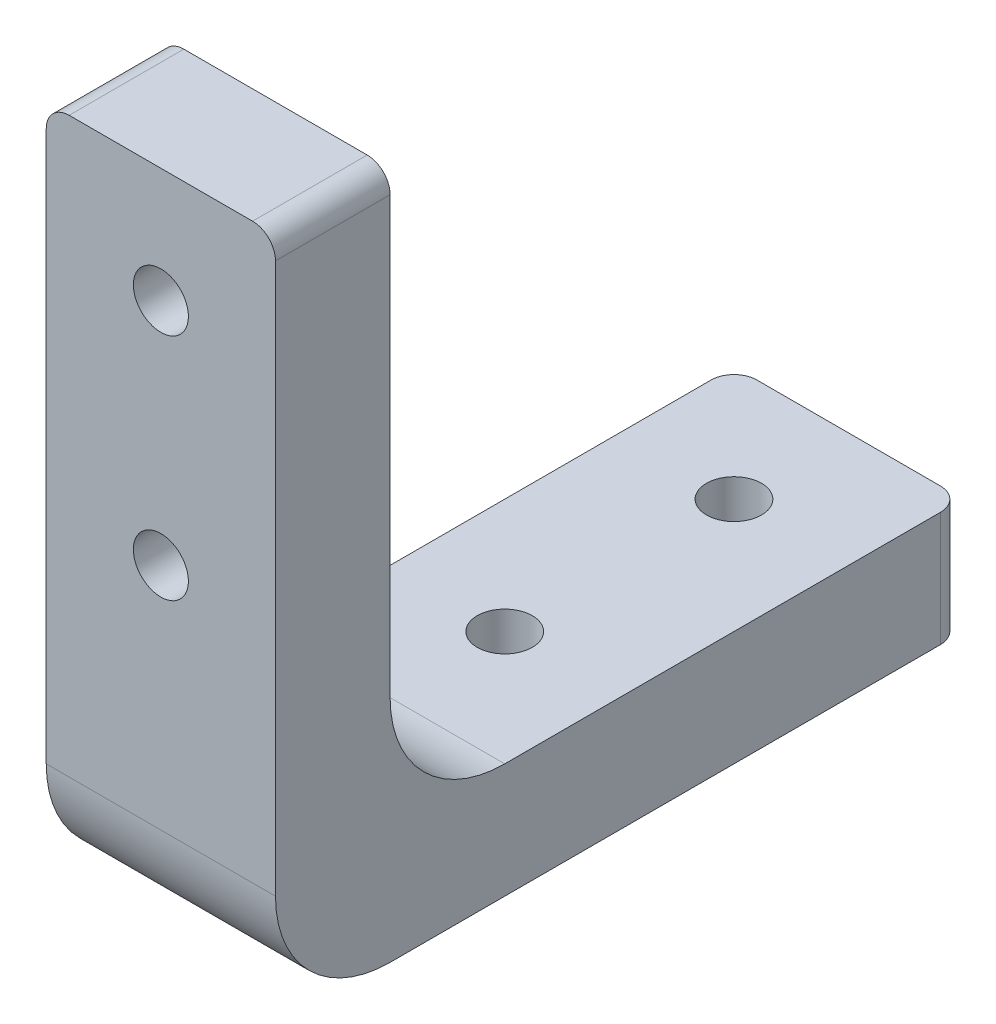
ISO-10303-21;
HEADER;
FILE_DESCRIPTION(('STEP AP214'),'2;1');
FILE_NAME('part.step','',(''),(''),'','','');
FILE_SCHEMA(('AUTOMOTIVE_DESIGN { 1 0 10303 214 1 1 1 1 }'));
ENDSEC;
DATA;
#1=APPLICATION_CONTEXT('core data for automotive mechanical design processes');
#2=APPLICATION_PROTOCOL_DEFINITION('international standard','automotive_design',2000,#1);
#3=PRODUCT_CONTEXT('',#1,'mechanical');
#4=PRODUCT('Part','Part','',(#3));
#5=PRODUCT_RELATED_PRODUCT_CATEGORY('part','',(#4));
#6=PRODUCT_DEFINITION_FORMATION('','',#4);
#7=PRODUCT_DEFINITION_CONTEXT('part definition',#1,'design');
#8=PRODUCT_DEFINITION('design','',#6,#7);
#9=PRODUCT_DEFINITION_SHAPE('','',#8);
#10=(LENGTH_UNIT() NAMED_UNIT(*) SI_UNIT(.MILLI.,.METRE.));
#11=(NAMED_UNIT(*) PLANE_ANGLE_UNIT() SI_UNIT($,.RADIAN.));
#12=(NAMED_UNIT(*) SI_UNIT($,.STERADIAN.) SOLID_ANGLE_UNIT());
#13=UNCERTAINTY_MEASURE_WITH_UNIT(LENGTH_MEASURE(1.E-05),#10,'distance_accuracy_value','');
#14=(GEOMETRIC_REPRESENTATION_CONTEXT(3) GLOBAL_UNCERTAINTY_ASSIGNED_CONTEXT((#13)) GLOBAL_UNIT_ASSIGNED_CONTEXT((#10,
#11,#12)) REPRESENTATION_CONTEXT('',''));
#15=CARTESIAN_POINT('',(0.,0.,0.));
#16=DIRECTION('',(0.,0.,1.));
#17=DIRECTION('',(1.,0.,0.));
#18=AXIS2_PLACEMENT_3D('',#15,#16,#17);
#19=CARTESIAN_POINT('',(-5.,30.,-5.));
#20=DIRECTION('',(0.,1.,0.));
#21=DIRECTION('',(0.,0.,1.));
#22=AXIS2_PLACEMENT_3D('',#19,#20,#21);
#23=PLANE('',#22);
#24=DIRECTION('',(1.,0.,0.));
#25=VECTOR('',#24,1.);
#26=CARTESIAN_POINT('',(-5.,30.,0.));
#27=LINE('',#26,#25);
#28=CARTESIAN_POINT('',(-4.,30.,0.));
#29=VERTEX_POINT('',#28);
#30=CARTESIAN_POINT('',(4.,30.,0.));
#31=VERTEX_POINT('',#30);
#32=EDGE_CURVE('E151',#29,#31,#27,.T.);
#33=ORIENTED_EDGE('',*,*,#32,.T.);
#34=DIRECTION('',(0.,0.,1.));
#35=VECTOR('',#34,1.);
#36=CARTESIAN_POINT('',(4.,30.,-5.));
#37=LINE('',#36,#35);
#38=CARTESIAN_POINT('',(4.,30.,-5.));
#39=VERTEX_POINT('',#38);
#40=EDGE_CURVE('E181',#31,#39,#37,.F.);
#41=ORIENTED_EDGE('',*,*,#40,.T.);
#42=DIRECTION('',(1.,0.,0.));
#43=VECTOR('',#42,1.);
#44=CARTESIAN_POINT('',(-5.,30.,-5.));
#45=LINE('',#44,#43);
#46=CARTESIAN_POINT('',(-4.,30.,-5.));
#47=VERTEX_POINT('',#46);
#48=EDGE_CURVE('E147',#47,#39,#45,.T.);
#49=ORIENTED_EDGE('',*,*,#48,.F.);
#50=DIRECTION('',(0.,0.,1.));
#51=VECTOR('',#50,1.);
#52=CARTESIAN_POINT('',(-4.,30.,0.));
#53=LINE('',#52,#51);
#54=EDGE_CURVE('E178',#47,#29,#53,.T.);
#55=ORIENTED_EDGE('',*,*,#54,.T.);
#56=EDGE_LOOP('',(#33,#41,#49,#55));
#57=FACE_BOUND('',#56,.T.);
#58=ADVANCED_FACE('F34',(#57),#23,.T.);
#59=CARTESIAN_POINT('',(-5.,5.,-5.));
#60=DIRECTION('',(0.,0.,-1.));
#61=DIRECTION('',(0.,1.,0.));
#62=AXIS2_PLACEMENT_3D('',#59,#60,#61);
#63=PLANE('',#62);
#64=CARTESIAN_POINT('',(0.,25.,-5.));
#65=DIRECTION('',(0.,0.,-1.));
#66=DIRECTION('',(0.,1.,0.));
#67=AXIS2_PLACEMENT_3D('',#64,#65,#66);
#68=CIRCLE('',#67,1.2);
#69=CARTESIAN_POINT('',(0.,26.2,-5.));
#70=VERTEX_POINT('',#69);
#71=EDGE_CURVE('E244',#70,#70,#68,.T.);
#72=ORIENTED_EDGE('',*,*,#71,.F.);
#73=EDGE_LOOP('',(#72));
#74=FACE_BOUND('',#73,.T.);
#75=CARTESIAN_POINT('',(0.,15.,-5.));
#76=DIRECTION('',(0.,0.,-1.));
#77=DIRECTION('',(0.,-1.,0.));
#78=AXIS2_PLACEMENT_3D('',#75,#76,#77);
#79=CIRCLE('',#78,1.2);
#80=CARTESIAN_POINT('',(0.,13.8,-5.));
#81=VERTEX_POINT('',#80);
#82=EDGE_CURVE('E238',#81,#81,#79,.T.);
#83=ORIENTED_EDGE('',*,*,#82,.F.);
#84=EDGE_LOOP('',(#83));
#85=FACE_BOUND('',#84,.T.);
#86=DIRECTION('',(0.,1.,0.));
#87=VECTOR('',#86,1.);
#88=CARTESIAN_POINT('',(5.,5.,-5.));
#89=LINE('',#88,#87);
#90=CARTESIAN_POINT('',(5.,10.,-5.));
#91=VERTEX_POINT('',#90);
#92=CARTESIAN_POINT('',(5.,29.,-5.));
#93=VERTEX_POINT('',#92);
#94=EDGE_CURVE('E204',#91,#93,#89,.T.);
#95=ORIENTED_EDGE('',*,*,#94,.F.);
#96=DIRECTION('',(1.,0.,0.));
#97=VECTOR('',#96,1.);
#98=CARTESIAN_POINT('',(-5.,10.,-5.));
#99=LINE('',#98,#97);
#100=CARTESIAN_POINT('',(-5.,10.,-5.));
#101=VERTEX_POINT('',#100);
#102=EDGE_CURVE('E49',#91,#101,#99,.F.);
#103=ORIENTED_EDGE('',*,*,#102,.T.);
#104=DIRECTION('',(0.,1.,0.));
#105=VECTOR('',#104,1.);
#106=CARTESIAN_POINT('',(-5.,5.,-5.));
#107=LINE('',#106,#105);
#108=CARTESIAN_POINT('',(-5.,29.,-5.));
#109=VERTEX_POINT('',#108);
#110=EDGE_CURVE('E157',#101,#109,#107,.T.);
#111=ORIENTED_EDGE('',*,*,#110,.T.);
#112=CARTESIAN_POINT('',(-4.,29.,-5.));
#113=DIRECTION('',(0.,0.,-1.));
#114=DIRECTION('',(0.,1.,0.));
#115=AXIS2_PLACEMENT_3D('',#112,#113,#114);
#116=CIRCLE('',#115,1.);
#117=EDGE_CURVE('E183',#109,#47,#116,.T.);
#118=ORIENTED_EDGE('',*,*,#117,.T.);
#119=ORIENTED_EDGE('',*,*,#48,.T.);
#120=CARTESIAN_POINT('',(4.,29.,-5.));
#121=DIRECTION('',(0.,0.,-1.));
#122=DIRECTION('',(0.,1.,0.));
#123=AXIS2_PLACEMENT_3D('',#120,#121,#122);
#124=CIRCLE('',#123,1.);
#125=EDGE_CURVE('E185',#39,#93,#124,.T.);
#126=ORIENTED_EDGE('',*,*,#125,.T.);
#127=EDGE_LOOP('',(#95,#103,#111,#118,#119,#126));
#128=FACE_BOUND('',#127,.T.);
#129=ADVANCED_FACE('F208',(#74,#85,#128),#63,.T.);
#130=CARTESIAN_POINT('',(-5.,5.,-30.));
#131=DIRECTION('',(0.,1.,0.));
#132=DIRECTION('',(0.,0.,1.));
#133=AXIS2_PLACEMENT_3D('',#130,#131,#132);
#134=PLANE('',#133);
#135=CARTESIAN_POINT('',(0.,5.,-25.));
#136=DIRECTION('',(0.,1.,0.));
#137=DIRECTION('',(0.,0.,1.));
#138=AXIS2_PLACEMENT_3D('',#135,#136,#137);
#139=CIRCLE('',#138,1.2);
#140=CARTESIAN_POINT('',(0.,5.,-23.8));
#141=VERTEX_POINT('',#140);
#142=EDGE_CURVE('E233',#141,#141,#139,.T.);
#143=ORIENTED_EDGE('',*,*,#142,.F.);
#144=EDGE_LOOP('',(#143));
#145=FACE_BOUND('',#144,.T.);
#146=CARTESIAN_POINT('',(0.,5.,-15.));
#147=DIRECTION('',(0.,1.,0.));
#148=DIRECTION('',(0.,0.,-1.));
#149=AXIS2_PLACEMENT_3D('',#146,#147,#148);
#150=CIRCLE('',#149,1.2);
#151=CARTESIAN_POINT('',(0.,5.,-16.2));
#152=VERTEX_POINT('',#151);
#153=EDGE_CURVE('E226',#152,#152,#150,.T.);
#154=ORIENTED_EDGE('',*,*,#153,.F.);
#155=EDGE_LOOP('',(#154));
#156=FACE_BOUND('',#155,.T.);
#157=DIRECTION('',(0.,0.,1.));
#158=VECTOR('',#157,1.);
#159=CARTESIAN_POINT('',(-5.,5.,-30.));
#160=LINE('',#159,#158);
#161=CARTESIAN_POINT('',(-5.,5.,-29.));
#162=VERTEX_POINT('',#161);
#163=CARTESIAN_POINT('',(-5.,5.,-10.));
#164=VERTEX_POINT('',#163);
#165=EDGE_CURVE('E213',#162,#164,#160,.T.);
#166=ORIENTED_EDGE('',*,*,#165,.T.);
#167=DIRECTION('',(1.,0.,0.));
#168=VECTOR('',#167,1.);
#169=CARTESIAN_POINT('',(5.,5.,-10.));
#170=LINE('',#169,#168);
#171=CARTESIAN_POINT('',(5.,5.,-10.));
#172=VERTEX_POINT('',#171);
#173=EDGE_CURVE('E197',#164,#172,#170,.T.);
#174=ORIENTED_EDGE('',*,*,#173,.T.);
#175=DIRECTION('',(0.,0.,1.));
#176=VECTOR('',#175,1.);
#177=CARTESIAN_POINT('',(5.,5.,-30.));
#178=LINE('',#177,#176);
#179=CARTESIAN_POINT('',(5.,5.,-29.));
#180=VERTEX_POINT('',#179);
#181=EDGE_CURVE('E205',#180,#172,#178,.T.);
#182=ORIENTED_EDGE('',*,*,#181,.F.);
#183=CARTESIAN_POINT('',(4.,5.,-29.));
#184=DIRECTION('',(0.,1.,0.));
#185=DIRECTION('',(0.,0.,1.));
#186=AXIS2_PLACEMENT_3D('',#183,#184,#185);
#187=CIRCLE('',#186,1.);
#188=CARTESIAN_POINT('',(4.,5.,-30.));
#189=VERTEX_POINT('',#188);
#190=EDGE_CURVE('E133',#180,#189,#187,.T.);
#191=ORIENTED_EDGE('',*,*,#190,.T.);
#192=DIRECTION('',(1.,0.,0.));
#193=VECTOR('',#192,1.);
#194=CARTESIAN_POINT('',(-5.,5.,-30.));
#195=LINE('',#194,#193);
#196=CARTESIAN_POINT('',(-4.,5.,-30.));
#197=VERTEX_POINT('',#196);
#198=EDGE_CURVE('E139',#197,#189,#195,.T.);
#199=ORIENTED_EDGE('',*,*,#198,.F.);
#200=CARTESIAN_POINT('',(-4.,5.,-29.));
#201=DIRECTION('',(0.,1.,0.));
#202=DIRECTION('',(0.,0.,1.));
#203=AXIS2_PLACEMENT_3D('',#200,#201,#202);
#204=CIRCLE('',#203,1.);
#205=EDGE_CURVE('E123',#197,#162,#204,.T.);
#206=ORIENTED_EDGE('',*,*,#205,.T.);
#207=EDGE_LOOP('',(#166,#174,#182,#191,#199,#206));
#208=FACE_BOUND('',#207,.T.);
#209=ADVANCED_FACE('F145',(#145,#156,#208),#134,.T.);
#210=CARTESIAN_POINT('',(-5.,0.,-30.));
#211=DIRECTION('',(0.,0.,-1.));
#212=DIRECTION('',(-1.,0.,0.));
#213=AXIS2_PLACEMENT_3D('',#210,#211,#212);
#214=PLANE('',#213);
#215=DIRECTION('',(1.,0.,0.));
#216=VECTOR('',#215,1.);
#217=CARTESIAN_POINT('',(-5.,0.,-30.));
#218=LINE('',#217,#216);
#219=CARTESIAN_POINT('',(-4.,0.,-30.));
#220=VERTEX_POINT('',#219);
#221=CARTESIAN_POINT('',(4.,0.,-30.));
#222=VERTEX_POINT('',#221);
#223=EDGE_CURVE('E142',#220,#222,#218,.T.);
#224=ORIENTED_EDGE('',*,*,#223,.F.);
#225=DIRECTION('',(0.,1.,0.));
#226=VECTOR('',#225,1.);
#227=CARTESIAN_POINT('',(-4.,5.,-30.));
#228=LINE('',#227,#226);
#229=EDGE_CURVE('E127',#220,#197,#228,.T.);
#230=ORIENTED_EDGE('',*,*,#229,.T.);
#231=ORIENTED_EDGE('',*,*,#198,.T.);
#232=DIRECTION('',(0.,1.,0.));
#233=VECTOR('',#232,1.);
#234=CARTESIAN_POINT('',(4.,0.,-30.));
#235=LINE('',#234,#233);
#236=EDGE_CURVE('E143',#189,#222,#235,.F.);
#237=ORIENTED_EDGE('',*,*,#236,.T.);
#238=EDGE_LOOP('',(#224,#230,#231,#237));
#239=FACE_BOUND('',#238,.T.);
#240=ADVANCED_FACE('F138',(#239),#214,.T.);
#241=CARTESIAN_POINT('',(-5.,0.,0.));
#242=DIRECTION('',(0.,-1.,0.));
#243=DIRECTION('',(0.,0.,-1.));
#244=AXIS2_PLACEMENT_3D('',#241,#242,#243);
#245=PLANE('',#244);
#246=CARTESIAN_POINT('',(0.,0.,-25.));
#247=DIRECTION('',(0.,1.,0.));
#248=DIRECTION('',(0.,0.,1.));
#249=AXIS2_PLACEMENT_3D('',#246,#247,#248);
#250=CIRCLE('',#249,1.2);
#251=CARTESIAN_POINT('',(0.,0.,-23.8));
#252=VERTEX_POINT('',#251);
#253=EDGE_CURVE('E225',#252,#252,#250,.T.);
#254=ORIENTED_EDGE('',*,*,#253,.T.);
#255=EDGE_LOOP('',(#254));
#256=FACE_BOUND('',#255,.T.);
#257=CARTESIAN_POINT('',(0.,0.,-15.));
#258=DIRECTION('',(0.,1.,0.));
#259=DIRECTION('',(0.,0.,-1.));
#260=AXIS2_PLACEMENT_3D('',#257,#258,#259);
#261=CIRCLE('',#260,1.2);
#262=CARTESIAN_POINT('',(0.,0.,-16.2));
#263=VERTEX_POINT('',#262);
#264=EDGE_CURVE('E229',#263,#263,#261,.T.);
#265=ORIENTED_EDGE('',*,*,#264,.T.);
#266=EDGE_LOOP('',(#265));
#267=FACE_BOUND('',#266,.T.);
#268=DIRECTION('',(0.,0.,-1.));
#269=VECTOR('',#268,1.);
#270=CARTESIAN_POINT('',(5.,0.,0.));
#271=LINE('',#270,#269);
#272=CARTESIAN_POINT('',(5.,0.,-5.));
#273=VERTEX_POINT('',#272);
#274=CARTESIAN_POINT('',(5.,0.,-29.));
#275=VERTEX_POINT('',#274);
#276=EDGE_CURVE('E221',#273,#275,#271,.T.);
#277=ORIENTED_EDGE('',*,*,#276,.F.);
#278=DIRECTION('',(1.,0.,0.));
#279=VECTOR('',#278,1.);
#280=CARTESIAN_POINT('',(-5.,0.,-5.));
#281=LINE('',#280,#279);
#282=CARTESIAN_POINT('',(-5.,0.,-5.));
#283=VERTEX_POINT('',#282);
#284=EDGE_CURVE('E193',#273,#283,#281,.F.);
#285=ORIENTED_EDGE('',*,*,#284,.T.);
#286=DIRECTION('',(0.,0.,-1.));
#287=VECTOR('',#286,1.);
#288=CARTESIAN_POINT('',(-5.,0.,0.));
#289=LINE('',#288,#287);
#290=CARTESIAN_POINT('',(-5.,0.,-29.));
#291=VERTEX_POINT('',#290);
#292=EDGE_CURVE('E214',#283,#291,#289,.T.);
#293=ORIENTED_EDGE('',*,*,#292,.T.);
#294=CARTESIAN_POINT('',(-4.,0.,-29.));
#295=DIRECTION('',(0.,-1.,0.));
#296=DIRECTION('',(0.,0.,-1.));
#297=AXIS2_PLACEMENT_3D('',#294,#295,#296);
#298=CIRCLE('',#297,1.);
#299=EDGE_CURVE('E166',#291,#220,#298,.T.);
#300=ORIENTED_EDGE('',*,*,#299,.T.);
#301=ORIENTED_EDGE('',*,*,#223,.T.);
#302=CARTESIAN_POINT('',(4.,0.,-29.));
#303=DIRECTION('',(0.,-1.,0.));
#304=DIRECTION('',(0.,0.,-1.));
#305=AXIS2_PLACEMENT_3D('',#302,#303,#304);
#306=CIRCLE('',#305,1.);
#307=EDGE_CURVE('E163',#222,#275,#306,.T.);
#308=ORIENTED_EDGE('',*,*,#307,.T.);
#309=EDGE_LOOP('',(#277,#285,#293,#300,#301,#308));
#310=FACE_BOUND('',#309,.T.);
#311=ADVANCED_FACE('F319',(#256,#267,#310),#245,.T.);
#312=CARTESIAN_POINT('',(-5.,30.,0.));
#313=DIRECTION('',(0.,0.,1.));
#314=DIRECTION('',(0.,-1.,0.));
#315=AXIS2_PLACEMENT_3D('',#312,#313,#314);
#316=PLANE('',#315);
#317=CARTESIAN_POINT('',(0.,25.,0.));
#318=DIRECTION('',(0.,0.,-1.));
#319=DIRECTION('',(0.,1.,0.));
#320=AXIS2_PLACEMENT_3D('',#317,#318,#319);
#321=CIRCLE('',#320,1.2);
#322=CARTESIAN_POINT('',(0.,26.2,0.));
#323=VERTEX_POINT('',#322);
#324=EDGE_CURVE('E230',#323,#323,#321,.T.);
#325=ORIENTED_EDGE('',*,*,#324,.T.);
#326=EDGE_LOOP('',(#325));
#327=FACE_BOUND('',#326,.T.);
#328=CARTESIAN_POINT('',(0.,15.,0.));
#329=DIRECTION('',(0.,0.,-1.));
#330=DIRECTION('',(0.,-1.,0.));
#331=AXIS2_PLACEMENT_3D('',#328,#329,#330);
#332=CIRCLE('',#331,1.2);
#333=CARTESIAN_POINT('',(0.,13.8,0.));
#334=VERTEX_POINT('',#333);
#335=EDGE_CURVE('E241',#334,#334,#332,.T.);
#336=ORIENTED_EDGE('',*,*,#335,.T.);
#337=EDGE_LOOP('',(#336));
#338=FACE_BOUND('',#337,.T.);
#339=DIRECTION('',(0.,-1.,0.));
#340=VECTOR('',#339,1.);
#341=CARTESIAN_POINT('',(-5.,30.,0.));
#342=LINE('',#341,#340);
#343=CARTESIAN_POINT('',(-5.,29.,0.));
#344=VERTEX_POINT('',#343);
#345=CARTESIAN_POINT('',(-5.,5.,0.));
#346=VERTEX_POINT('',#345);
#347=EDGE_CURVE('E211',#344,#346,#342,.T.);
#348=ORIENTED_EDGE('',*,*,#347,.T.);
#349=DIRECTION('',(1.,0.,0.));
#350=VECTOR('',#349,1.);
#351=CARTESIAN_POINT('',(-5.,5.,0.));
#352=LINE('',#351,#350);
#353=CARTESIAN_POINT('',(5.,5.,0.));
#354=VERTEX_POINT('',#353);
#355=EDGE_CURVE('E188',#346,#354,#352,.T.);
#356=ORIENTED_EDGE('',*,*,#355,.T.);
#357=DIRECTION('',(0.,-1.,0.));
#358=VECTOR('',#357,1.);
#359=CARTESIAN_POINT('',(5.,30.,0.));
#360=LINE('',#359,#358);
#361=CARTESIAN_POINT('',(5.,29.,0.));
#362=VERTEX_POINT('',#361);
#363=EDGE_CURVE('E223',#362,#354,#360,.T.);
#364=ORIENTED_EDGE('',*,*,#363,.F.);
#365=CARTESIAN_POINT('',(4.,29.,0.));
#366=DIRECTION('',(0.,0.,1.));
#367=DIRECTION('',(0.,-1.,0.));
#368=AXIS2_PLACEMENT_3D('',#365,#366,#367);
#369=CIRCLE('',#368,1.);
#370=EDGE_CURVE('E176',#362,#31,#369,.T.);
#371=ORIENTED_EDGE('',*,*,#370,.T.);
#372=ORIENTED_EDGE('',*,*,#32,.F.);
#373=CARTESIAN_POINT('',(-4.,29.,0.));
#374=DIRECTION('',(0.,0.,1.));
#375=DIRECTION('',(0.,-1.,0.));
#376=AXIS2_PLACEMENT_3D('',#373,#374,#375);
#377=CIRCLE('',#376,1.);
#378=EDGE_CURVE('E174',#29,#344,#377,.T.);
#379=ORIENTED_EDGE('',*,*,#378,.T.);
#380=EDGE_LOOP('',(#348,#356,#364,#371,#372,#379));
#381=FACE_BOUND('',#380,.T.);
#382=ADVANCED_FACE('F250',(#327,#338,#381),#316,.T.);
#383=CARTESIAN_POINT('',(-5.,0.,0.));
#384=DIRECTION('',(1.,0.,0.));
#385=DIRECTION('',(0.,0.,-1.));
#386=AXIS2_PLACEMENT_3D('',#383,#384,#385);
#387=PLANE('',#386);
#388=ORIENTED_EDGE('',*,*,#292,.F.);
#389=CARTESIAN_POINT('',(-5.,5.,-5.));
#390=DIRECTION('',(1.,0.,0.));
#391=DIRECTION('',(0.,0.,-1.));
#392=AXIS2_PLACEMENT_3D('',#389,#390,#391);
#393=CIRCLE('',#392,5.);
#394=EDGE_CURVE('E195',#283,#346,#393,.F.);
#395=ORIENTED_EDGE('',*,*,#394,.T.);
#396=ORIENTED_EDGE('',*,*,#347,.F.);
#397=DIRECTION('',(0.,0.,1.));
#398=VECTOR('',#397,1.);
#399=CARTESIAN_POINT('',(-5.,29.,-5.));
#400=LINE('',#399,#398);
#401=EDGE_CURVE('E132',#344,#109,#400,.F.);
#402=ORIENTED_EDGE('',*,*,#401,.T.);
#403=ORIENTED_EDGE('',*,*,#110,.F.);
#404=CARTESIAN_POINT('',(-5.,10.,-10.));
#405=DIRECTION('',(1.,0.,0.));
#406=DIRECTION('',(0.,0.,-1.));
#407=AXIS2_PLACEMENT_3D('',#404,#405,#406);
#408=CIRCLE('',#407,5.);
#409=EDGE_CURVE('E11',#101,#164,#408,.T.);
#410=ORIENTED_EDGE('',*,*,#409,.T.);
#411=ORIENTED_EDGE('',*,*,#165,.F.);
#412=DIRECTION('',(0.,1.,0.));
#413=VECTOR('',#412,1.);
#414=CARTESIAN_POINT('',(-5.,0.,-29.));
#415=LINE('',#414,#413);
#416=EDGE_CURVE('E129',#162,#291,#415,.F.);
#417=ORIENTED_EDGE('',*,*,#416,.T.);
#418=EDGE_LOOP('',(#388,#395,#396,#402,#403,#410,#411,#417));
#419=FACE_BOUND('',#418,.T.);
#420=ADVANCED_FACE('F308',(#419),#387,.F.);
#421=CARTESIAN_POINT('',(5.,0.,0.));
#422=DIRECTION('',(1.,0.,0.));
#423=DIRECTION('',(0.,0.,-1.));
#424=AXIS2_PLACEMENT_3D('',#421,#422,#423);
#425=PLANE('',#424);
#426=ORIENTED_EDGE('',*,*,#363,.T.);
#427=CARTESIAN_POINT('',(5.,5.,-5.));
#428=DIRECTION('',(1.,0.,0.));
#429=DIRECTION('',(0.,0.,-1.));
#430=AXIS2_PLACEMENT_3D('',#427,#428,#429);
#431=CIRCLE('',#430,5.);
#432=EDGE_CURVE('E191',#354,#273,#431,.T.);
#433=ORIENTED_EDGE('',*,*,#432,.T.);
#434=ORIENTED_EDGE('',*,*,#276,.T.);
#435=DIRECTION('',(0.,1.,0.));
#436=VECTOR('',#435,1.);
#437=CARTESIAN_POINT('',(5.,0.,-29.));
#438=LINE('',#437,#436);
#439=EDGE_CURVE('E171',#275,#180,#438,.T.);
#440=ORIENTED_EDGE('',*,*,#439,.T.);
#441=ORIENTED_EDGE('',*,*,#181,.T.);
#442=CARTESIAN_POINT('',(5.,10.,-10.));
#443=DIRECTION('',(1.,0.,0.));
#444=DIRECTION('',(0.,0.,-1.));
#445=AXIS2_PLACEMENT_3D('',#442,#443,#444);
#446=CIRCLE('',#445,5.);
#447=EDGE_CURVE('E42',#172,#91,#446,.F.);
#448=ORIENTED_EDGE('',*,*,#447,.T.);
#449=ORIENTED_EDGE('',*,*,#94,.T.);
#450=DIRECTION('',(0.,0.,1.));
#451=VECTOR('',#450,1.);
#452=CARTESIAN_POINT('',(5.,29.,0.));
#453=LINE('',#452,#451);
#454=EDGE_CURVE('E168',#93,#362,#453,.T.);
#455=ORIENTED_EDGE('',*,*,#454,.T.);
#456=EDGE_LOOP('',(#426,#433,#434,#440,#441,#448,#449,#455));
#457=FACE_BOUND('',#456,.T.);
#458=ADVANCED_FACE('F203',(#457),#425,.T.);
#459=CARTESIAN_POINT('',(0.,0.,-15.));
#460=DIRECTION('',(0.,1.,0.));
#461=DIRECTION('',(0.,0.,1.));
#462=AXIS2_PLACEMENT_3D('',#459,#460,#461);
#463=CYLINDRICAL_SURFACE('',#462,1.2);
#464=ORIENTED_EDGE('',*,*,#264,.F.);
#465=EDGE_LOOP('',(#464));
#466=FACE_BOUND('',#465,.T.);
#467=ORIENTED_EDGE('',*,*,#153,.T.);
#468=EDGE_LOOP('',(#467));
#469=FACE_BOUND('',#468,.T.);
#470=ADVANCED_FACE('F272',(#466,#469),#463,.F.);
#471=CARTESIAN_POINT('',(0.,0.,-25.));
#472=DIRECTION('',(0.,1.,0.));
#473=DIRECTION('',(0.,0.,1.));
#474=AXIS2_PLACEMENT_3D('',#471,#472,#473);
#475=CYLINDRICAL_SURFACE('',#474,1.2);
#476=ORIENTED_EDGE('',*,*,#253,.F.);
#477=EDGE_LOOP('',(#476));
#478=FACE_BOUND('',#477,.T.);
#479=ORIENTED_EDGE('',*,*,#142,.T.);
#480=EDGE_LOOP('',(#479));
#481=FACE_BOUND('',#480,.T.);
#482=ADVANCED_FACE('F266',(#478,#481),#475,.F.);
#483=CARTESIAN_POINT('',(0.,15.,0.));
#484=DIRECTION('',(0.,0.,-1.));
#485=DIRECTION('',(0.,1.,0.));
#486=AXIS2_PLACEMENT_3D('',#483,#484,#485);
#487=CYLINDRICAL_SURFACE('',#486,1.2);
#488=ORIENTED_EDGE('',*,*,#335,.F.);
#489=EDGE_LOOP('',(#488));
#490=FACE_BOUND('',#489,.T.);
#491=ORIENTED_EDGE('',*,*,#82,.T.);
#492=EDGE_LOOP('',(#491));
#493=FACE_BOUND('',#492,.T.);
#494=ADVANCED_FACE('F256',(#490,#493),#487,.F.);
#495=CARTESIAN_POINT('',(0.,25.,0.));
#496=DIRECTION('',(0.,0.,-1.));
#497=DIRECTION('',(0.,1.,0.));
#498=AXIS2_PLACEMENT_3D('',#495,#496,#497);
#499=CYLINDRICAL_SURFACE('',#498,1.2);
#500=ORIENTED_EDGE('',*,*,#324,.F.);
#501=EDGE_LOOP('',(#500));
#502=FACE_BOUND('',#501,.T.);
#503=ORIENTED_EDGE('',*,*,#71,.T.);
#504=EDGE_LOOP('',(#503));
#505=FACE_BOUND('',#504,.T.);
#506=ADVANCED_FACE('F253',(#502,#505),#499,.F.);
#507=CARTESIAN_POINT('',(-4.,0.,-29.));
#508=DIRECTION('',(0.,-1.,0.));
#509=DIRECTION('',(0.,0.,-1.));
#510=AXIS2_PLACEMENT_3D('',#507,#508,#509);
#511=CYLINDRICAL_SURFACE('',#510,1.);
#512=ORIENTED_EDGE('',*,*,#299,.F.);
#513=ORIENTED_EDGE('',*,*,#416,.F.);
#514=ORIENTED_EDGE('',*,*,#205,.F.);
#515=ORIENTED_EDGE('',*,*,#229,.F.);
#516=EDGE_LOOP('',(#512,#513,#514,#515));
#517=FACE_BOUND('',#516,.T.);
#518=ADVANCED_FACE('F126',(#517),#511,.T.);
#519=CARTESIAN_POINT('',(4.,0.,-29.));
#520=DIRECTION('',(0.,1.,0.));
#521=DIRECTION('',(0.,0.,1.));
#522=AXIS2_PLACEMENT_3D('',#519,#520,#521);
#523=CYLINDRICAL_SURFACE('',#522,1.);
#524=ORIENTED_EDGE('',*,*,#307,.F.);
#525=ORIENTED_EDGE('',*,*,#236,.F.);
#526=ORIENTED_EDGE('',*,*,#190,.F.);
#527=ORIENTED_EDGE('',*,*,#439,.F.);
#528=EDGE_LOOP('',(#524,#525,#526,#527));
#529=FACE_BOUND('',#528,.T.);
#530=ADVANCED_FACE('F286',(#529),#523,.T.);
#531=CARTESIAN_POINT('',(4.,29.,0.));
#532=DIRECTION('',(0.,0.,1.));
#533=DIRECTION('',(1.,0.,0.));
#534=AXIS2_PLACEMENT_3D('',#531,#532,#533);
#535=CYLINDRICAL_SURFACE('',#534,1.);
#536=ORIENTED_EDGE('',*,*,#125,.F.);
#537=ORIENTED_EDGE('',*,*,#40,.F.);
#538=ORIENTED_EDGE('',*,*,#370,.F.);
#539=ORIENTED_EDGE('',*,*,#454,.F.);
#540=EDGE_LOOP('',(#536,#537,#538,#539));
#541=FACE_BOUND('',#540,.T.);
#542=ADVANCED_FACE('F289',(#541),#535,.T.);
#543=CARTESIAN_POINT('',(-4.,29.,-5.));
#544=DIRECTION('',(0.,0.,-1.));
#545=DIRECTION('',(-1.,0.,0.));
#546=AXIS2_PLACEMENT_3D('',#543,#544,#545);
#547=CYLINDRICAL_SURFACE('',#546,1.);
#548=ORIENTED_EDGE('',*,*,#117,.F.);
#549=ORIENTED_EDGE('',*,*,#401,.F.);
#550=ORIENTED_EDGE('',*,*,#378,.F.);
#551=ORIENTED_EDGE('',*,*,#54,.F.);
#552=EDGE_LOOP('',(#548,#549,#550,#551));
#553=FACE_BOUND('',#552,.T.);
#554=ADVANCED_FACE('F293',(#553),#547,.T.);
#555=CARTESIAN_POINT('',(-5.,5.,-5.));
#556=DIRECTION('',(1.,0.,0.));
#557=DIRECTION('',(0.,0.,-1.));
#558=AXIS2_PLACEMENT_3D('',#555,#556,#557);
#559=CYLINDRICAL_SURFACE('',#558,5.);
#560=ORIENTED_EDGE('',*,*,#394,.F.);
#561=ORIENTED_EDGE('',*,*,#284,.F.);
#562=ORIENTED_EDGE('',*,*,#432,.F.);
#563=ORIENTED_EDGE('',*,*,#355,.F.);
#564=EDGE_LOOP('',(#560,#561,#562,#563));
#565=FACE_BOUND('',#564,.T.);
#566=ADVANCED_FACE('F296',(#565),#559,.T.);
#567=CARTESIAN_POINT('',(-5.,10.,-10.));
#568=DIRECTION('',(-1.,0.,0.));
#569=DIRECTION('',(0.,0.,1.));
#570=AXIS2_PLACEMENT_3D('',#567,#568,#569);
#571=CYLINDRICAL_SURFACE('',#570,5.);
#572=ORIENTED_EDGE('',*,*,#409,.F.);
#573=ORIENTED_EDGE('',*,*,#102,.F.);
#574=ORIENTED_EDGE('',*,*,#447,.F.);
#575=ORIENTED_EDGE('',*,*,#173,.F.);
#576=EDGE_LOOP('',(#572,#573,#574,#575));
#577=FACE_BOUND('',#576,.T.);
#578=ADVANCED_FACE('F36',(#577),#571,.F.);
#579=CLOSED_SHELL('',(#58,#129,#209,#240,#311,#382,#420,#458,#470,#482,#494,#506,#518,#530,#542,
#554,#566,#578));
#580=MANIFOLD_SOLID_BREP('B2',#579);
#581=ADVANCED_BREP_SHAPE_REPRESENTATION('',(#18,#580),#14);
#582=SHAPE_DEFINITION_REPRESENTATION(#9,#581);
ENDSEC;
END-ISO-10303-21;
